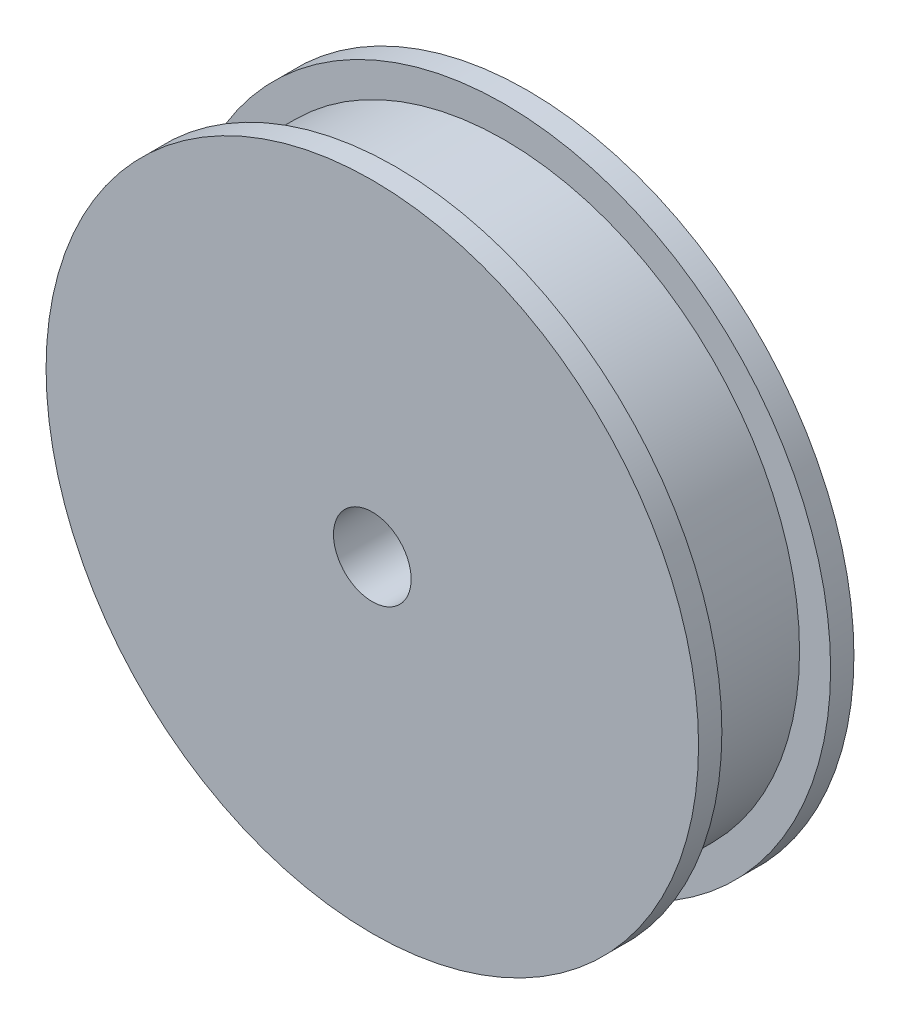
ISO-10303-21;
HEADER;
FILE_DESCRIPTION(('STEP AP214'),'2;1');
FILE_NAME('part.step','',(''),(''),'','','');
FILE_SCHEMA(('AUTOMOTIVE_DESIGN { 1 0 10303 214 1 1 1 1 }'));
ENDSEC;
DATA;
#1=APPLICATION_CONTEXT('core data for automotive mechanical design processes');
#2=APPLICATION_PROTOCOL_DEFINITION('international standard','automotive_design',2000,#1);
#3=PRODUCT_CONTEXT('',#1,'mechanical');
#4=PRODUCT('Part','Part','',(#3));
#5=PRODUCT_RELATED_PRODUCT_CATEGORY('part','',(#4));
#6=PRODUCT_DEFINITION_FORMATION('','',#4);
#7=PRODUCT_DEFINITION_CONTEXT('part definition',#1,'design');
#8=PRODUCT_DEFINITION('design','',#6,#7);
#9=PRODUCT_DEFINITION_SHAPE('','',#8);
#10=(LENGTH_UNIT() NAMED_UNIT(*) SI_UNIT(.MILLI.,.METRE.));
#11=(NAMED_UNIT(*) PLANE_ANGLE_UNIT() SI_UNIT($,.RADIAN.));
#12=(NAMED_UNIT(*) SI_UNIT($,.STERADIAN.) SOLID_ANGLE_UNIT());
#13=UNCERTAINTY_MEASURE_WITH_UNIT(LENGTH_MEASURE(1.E-05),#10,'distance_accuracy_value','');
#14=(GEOMETRIC_REPRESENTATION_CONTEXT(3) GLOBAL_UNCERTAINTY_ASSIGNED_CONTEXT((#13)) GLOBAL_UNIT_ASSIGNED_CONTEXT((#10,
#11,#12)) REPRESENTATION_CONTEXT('',''));
#15=CARTESIAN_POINT('',(0.,0.,0.));
#16=DIRECTION('',(0.,0.,1.));
#17=DIRECTION('',(1.,0.,0.));
#18=AXIS2_PLACEMENT_3D('',#15,#16,#17);
#19=CARTESIAN_POINT('',(0.,0.,0.));
#20=DIRECTION('',(0.,0.,1.));
#21=DIRECTION('',(1.,0.,0.));
#22=AXIS2_PLACEMENT_3D('',#19,#20,#21);
#23=PLANE('',#22);
#24=CARTESIAN_POINT('',(0.,0.,0.));
#25=DIRECTION('',(0.,0.,-1.));
#26=DIRECTION('',(-1.,0.,0.));
#27=AXIS2_PLACEMENT_3D('',#24,#25,#26);
#28=CIRCLE('',#27,2.5);
#29=CARTESIAN_POINT('',(-2.5,0.,0.));
#30=VERTEX_POINT('',#29);
#31=EDGE_CURVE('E64',#30,#30,#28,.T.);
#32=ORIENTED_EDGE('',*,*,#31,.T.);
#33=EDGE_LOOP('',(#32));
#34=FACE_BOUND('',#33,.T.);
#35=CARTESIAN_POINT('',(0.,0.,0.));
#36=DIRECTION('',(0.,0.,-1.));
#37=DIRECTION('',(-1.,0.,0.));
#38=AXIS2_PLACEMENT_3D('',#35,#36,#37);
#39=CIRCLE('',#38,21.);
#40=CARTESIAN_POINT('',(-21.,0.,0.));
#41=VERTEX_POINT('',#40);
#42=EDGE_CURVE('E10',#41,#41,#39,.T.);
#43=ORIENTED_EDGE('',*,*,#42,.F.);
#44=EDGE_LOOP('',(#43));
#45=FACE_BOUND('',#44,.T.);
#46=ADVANCED_FACE('F35',(#34,#45),#23,.T.);
#47=CARTESIAN_POINT('',(0.,0.,-10.));
#48=DIRECTION('',(0.,0.,-1.));
#49=DIRECTION('',(-1.,0.,0.));
#50=AXIS2_PLACEMENT_3D('',#47,#48,#49);
#51=CYLINDRICAL_SURFACE('',#50,21.);
#52=ORIENTED_EDGE('',*,*,#42,.T.);
#53=EDGE_LOOP('',(#52));
#54=FACE_BOUND('',#53,.T.);
#55=CARTESIAN_POINT('',(0.,0.,-1.5));
#56=DIRECTION('',(0.,0.,-1.));
#57=DIRECTION('',(-1.,0.,0.));
#58=AXIS2_PLACEMENT_3D('',#55,#56,#57);
#59=CIRCLE('',#58,21.);
#60=CARTESIAN_POINT('',(-21.,0.,-1.5));
#61=VERTEX_POINT('',#60);
#62=EDGE_CURVE('E41',#61,#61,#59,.T.);
#63=ORIENTED_EDGE('',*,*,#62,.F.);
#64=EDGE_LOOP('',(#63));
#65=FACE_BOUND('',#64,.T.);
#66=ADVANCED_FACE('F111',(#54,#65),#51,.T.);
#67=CARTESIAN_POINT('',(0.,21.,-1.5));
#68=DIRECTION('',(0.,0.,-1.));
#69=DIRECTION('',(-1.,0.,0.));
#70=AXIS2_PLACEMENT_3D('',#67,#68,#69);
#71=PLANE('',#70);
#72=ORIENTED_EDGE('',*,*,#62,.T.);
#73=EDGE_LOOP('',(#72));
#74=FACE_BOUND('',#73,.T.);
#75=CARTESIAN_POINT('',(0.,0.,-1.5));
#76=DIRECTION('',(0.,0.,-1.));
#77=DIRECTION('',(-1.,0.,0.));
#78=AXIS2_PLACEMENT_3D('',#75,#76,#77);
#79=CIRCLE('',#78,19.);
#80=CARTESIAN_POINT('',(-19.,0.,-1.5));
#81=VERTEX_POINT('',#80);
#82=EDGE_CURVE('E45',#81,#81,#79,.T.);
#83=ORIENTED_EDGE('',*,*,#82,.F.);
#84=EDGE_LOOP('',(#83));
#85=FACE_BOUND('',#84,.T.);
#86=ADVANCED_FACE('F115',(#74,#85),#71,.T.);
#87=CARTESIAN_POINT('',(0.,0.,-10.));
#88=DIRECTION('',(0.,0.,-1.));
#89=DIRECTION('',(-1.,0.,0.));
#90=AXIS2_PLACEMENT_3D('',#87,#88,#89);
#91=CYLINDRICAL_SURFACE('',#90,19.);
#92=ORIENTED_EDGE('',*,*,#82,.T.);
#93=EDGE_LOOP('',(#92));
#94=FACE_BOUND('',#93,.T.);
#95=CARTESIAN_POINT('',(0.,0.,-8.5));
#96=DIRECTION('',(0.,0.,-1.));
#97=DIRECTION('',(-1.,0.,0.));
#98=AXIS2_PLACEMENT_3D('',#95,#96,#97);
#99=CIRCLE('',#98,19.);
#100=CARTESIAN_POINT('',(-19.,0.,-8.5));
#101=VERTEX_POINT('',#100);
#102=EDGE_CURVE('E49',#101,#101,#99,.T.);
#103=ORIENTED_EDGE('',*,*,#102,.F.);
#104=EDGE_LOOP('',(#103));
#105=FACE_BOUND('',#104,.T.);
#106=ADVANCED_FACE('F107',(#94,#105),#91,.T.);
#107=CARTESIAN_POINT('',(0.,19.,-8.5));
#108=DIRECTION('',(0.,0.,1.));
#109=DIRECTION('',(1.,0.,0.));
#110=AXIS2_PLACEMENT_3D('',#107,#108,#109);
#111=PLANE('',#110);
#112=ORIENTED_EDGE('',*,*,#102,.T.);
#113=EDGE_LOOP('',(#112));
#114=FACE_BOUND('',#113,.T.);
#115=CARTESIAN_POINT('',(0.,0.,-8.5));
#116=DIRECTION('',(0.,0.,-1.));
#117=DIRECTION('',(-1.,0.,0.));
#118=AXIS2_PLACEMENT_3D('',#115,#116,#117);
#119=CIRCLE('',#118,21.);
#120=CARTESIAN_POINT('',(-21.,0.,-8.5));
#121=VERTEX_POINT('',#120);
#122=EDGE_CURVE('E54',#121,#121,#119,.T.);
#123=ORIENTED_EDGE('',*,*,#122,.F.);
#124=EDGE_LOOP('',(#123));
#125=FACE_BOUND('',#124,.T.);
#126=ADVANCED_FACE('F101',(#114,#125),#111,.T.);
#127=CARTESIAN_POINT('',(0.,0.,-10.));
#128=DIRECTION('',(0.,0.,-1.));
#129=DIRECTION('',(-1.,0.,0.));
#130=AXIS2_PLACEMENT_3D('',#127,#128,#129);
#131=CYLINDRICAL_SURFACE('',#130,21.);
#132=ORIENTED_EDGE('',*,*,#122,.T.);
#133=EDGE_LOOP('',(#132));
#134=FACE_BOUND('',#133,.T.);
#135=CARTESIAN_POINT('',(0.,0.,-10.));
#136=DIRECTION('',(0.,0.,-1.));
#137=DIRECTION('',(-1.,0.,0.));
#138=AXIS2_PLACEMENT_3D('',#135,#136,#137);
#139=CIRCLE('',#138,21.);
#140=CARTESIAN_POINT('',(-21.,0.,-10.));
#141=VERTEX_POINT('',#140);
#142=EDGE_CURVE('E57',#141,#141,#139,.T.);
#143=ORIENTED_EDGE('',*,*,#142,.F.);
#144=EDGE_LOOP('',(#143));
#145=FACE_BOUND('',#144,.T.);
#146=ADVANCED_FACE('F96',(#134,#145),#131,.T.);
#147=CARTESIAN_POINT('',(0.,21.,-10.));
#148=DIRECTION('',(0.,0.,-1.));
#149=DIRECTION('',(-1.,0.,0.));
#150=AXIS2_PLACEMENT_3D('',#147,#148,#149);
#151=PLANE('',#150);
#152=CARTESIAN_POINT('',(0.,0.,-10.));
#153=DIRECTION('',(0.,0.,-1.));
#154=DIRECTION('',(-1.,0.,0.));
#155=AXIS2_PLACEMENT_3D('',#152,#153,#154);
#156=CIRCLE('',#155,10.);
#157=CARTESIAN_POINT('',(-10.,0.,-10.));
#158=VERTEX_POINT('',#157);
#159=EDGE_CURVE('E61',#158,#158,#156,.T.);
#160=ORIENTED_EDGE('',*,*,#159,.F.);
#161=EDGE_LOOP('',(#160));
#162=FACE_BOUND('',#161,.T.);
#163=ORIENTED_EDGE('',*,*,#142,.T.);
#164=EDGE_LOOP('',(#163));
#165=FACE_BOUND('',#164,.T.);
#166=ADVANCED_FACE('F90',(#162,#165),#151,.T.);
#167=CARTESIAN_POINT('',(0.,0.,-17.));
#168=DIRECTION('',(0.,0.,1.));
#169=DIRECTION('',(1.,0.,0.));
#170=AXIS2_PLACEMENT_3D('',#167,#168,#169);
#171=CYLINDRICAL_SURFACE('',#170,10.);
#172=CARTESIAN_POINT('',(0.,0.,-17.));
#173=DIRECTION('',(0.,0.,-1.));
#174=DIRECTION('',(-1.,0.,0.));
#175=AXIS2_PLACEMENT_3D('',#172,#173,#174);
#176=CIRCLE('',#175,10.);
#177=CARTESIAN_POINT('',(-10.,0.,-17.));
#178=VERTEX_POINT('',#177);
#179=EDGE_CURVE('E60',#178,#178,#176,.T.);
#180=ORIENTED_EDGE('',*,*,#179,.F.);
#181=EDGE_LOOP('',(#180));
#182=FACE_BOUND('',#181,.T.);
#183=ORIENTED_EDGE('',*,*,#159,.T.);
#184=EDGE_LOOP('',(#183));
#185=FACE_BOUND('',#184,.T.);
#186=ADVANCED_FACE('F84',(#182,#185),#171,.T.);
#187=CARTESIAN_POINT('',(0.,0.,-17.));
#188=DIRECTION('',(0.,0.,-1.));
#189=DIRECTION('',(-1.,0.,0.));
#190=AXIS2_PLACEMENT_3D('',#187,#188,#189);
#191=PLANE('',#190);
#192=CARTESIAN_POINT('',(0.,0.,-17.));
#193=DIRECTION('',(0.,0.,-1.));
#194=DIRECTION('',(-1.,0.,0.));
#195=AXIS2_PLACEMENT_3D('',#192,#193,#194);
#196=CIRCLE('',#195,2.5);
#197=CARTESIAN_POINT('',(-2.5,0.,-17.));
#198=VERTEX_POINT('',#197);
#199=EDGE_CURVE('E67',#198,#198,#196,.T.);
#200=ORIENTED_EDGE('',*,*,#199,.F.);
#201=EDGE_LOOP('',(#200));
#202=FACE_BOUND('',#201,.T.);
#203=ORIENTED_EDGE('',*,*,#179,.T.);
#204=EDGE_LOOP('',(#203));
#205=FACE_BOUND('',#204,.T.);
#206=ADVANCED_FACE('F78',(#202,#205),#191,.T.);
#207=CARTESIAN_POINT('',(0.,0.,0.));
#208=DIRECTION('',(0.,0.,-1.));
#209=DIRECTION('',(-1.,0.,0.));
#210=AXIS2_PLACEMENT_3D('',#207,#208,#209);
#211=CYLINDRICAL_SURFACE('',#210,2.5);
#212=ORIENTED_EDGE('',*,*,#31,.F.);
#213=EDGE_LOOP('',(#212));
#214=FACE_BOUND('',#213,.T.);
#215=ORIENTED_EDGE('',*,*,#199,.T.);
#216=EDGE_LOOP('',(#215));
#217=FACE_BOUND('',#216,.T.);
#218=ADVANCED_FACE('F75',(#214,#217),#211,.F.);
#219=CLOSED_SHELL('',(#46,#66,#86,#106,#126,#146,#166,#186,#206,#218));
#220=MANIFOLD_SOLID_BREP('B2',#219);
#221=ADVANCED_BREP_SHAPE_REPRESENTATION('',(#18,#220),#14);
#222=SHAPE_DEFINITION_REPRESENTATION(#9,#221);
ENDSEC;
END-ISO-10303-21;
